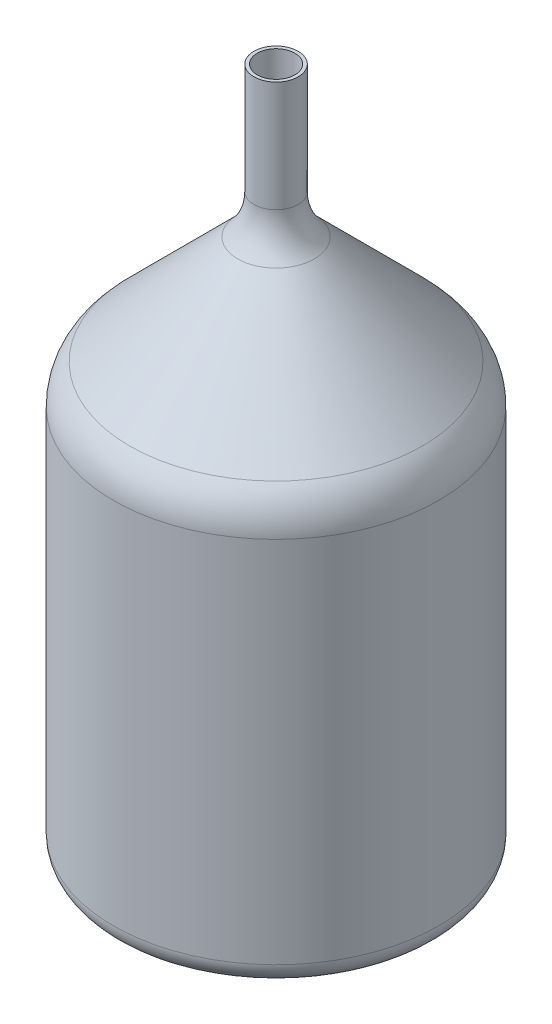
ISO-10303-21;
HEADER;
FILE_DESCRIPTION(('STEP AP214'),'2;1');
FILE_NAME('part.step','',(''),(''),'','','');
FILE_SCHEMA(('AUTOMOTIVE_DESIGN { 1 0 10303 214 1 1 1 1 }'));
ENDSEC;
DATA;
#1=APPLICATION_CONTEXT('core data for automotive mechanical design processes');
#2=APPLICATION_PROTOCOL_DEFINITION('international standard','automotive_design',2000,#1);
#3=PRODUCT_CONTEXT('',#1,'mechanical');
#4=PRODUCT('Part','Part','',(#3));
#5=PRODUCT_RELATED_PRODUCT_CATEGORY('part','',(#4));
#6=PRODUCT_DEFINITION_FORMATION('','',#4);
#7=PRODUCT_DEFINITION_CONTEXT('part definition',#1,'design');
#8=PRODUCT_DEFINITION('design','',#6,#7);
#9=PRODUCT_DEFINITION_SHAPE('','',#8);
#10=(LENGTH_UNIT() NAMED_UNIT(*) SI_UNIT(.MILLI.,.METRE.));
#11=(NAMED_UNIT(*) PLANE_ANGLE_UNIT() SI_UNIT($,.RADIAN.));
#12=(NAMED_UNIT(*) SI_UNIT($,.STERADIAN.) SOLID_ANGLE_UNIT());
#13=UNCERTAINTY_MEASURE_WITH_UNIT(LENGTH_MEASURE(1.E-05),#10,'distance_accuracy_value','');
#14=(GEOMETRIC_REPRESENTATION_CONTEXT(3) GLOBAL_UNCERTAINTY_ASSIGNED_CONTEXT((#13)) GLOBAL_UNIT_ASSIGNED_CONTEXT((#10,
#11,#12)) REPRESENTATION_CONTEXT('',''));
#15=CARTESIAN_POINT('',(0.,0.,0.));
#16=DIRECTION('',(0.,0.,1.));
#17=DIRECTION('',(1.,0.,0.));
#18=AXIS2_PLACEMENT_3D('',#15,#16,#17);
#19=CARTESIAN_POINT('',(0.,0.,0.));
#20=DIRECTION('',(0.,-1.,0.));
#21=DIRECTION('',(0.,0.,-1.));
#22=AXIS2_PLACEMENT_3D('',#19,#20,#21);
#23=CYLINDRICAL_SURFACE('',#22,8.5);
#24=CARTESIAN_POINT('',(0.,260.8,0.));
#25=DIRECTION('',(0.,-1.,0.));
#26=DIRECTION('',(0.,0.,-1.));
#27=AXIS2_PLACEMENT_3D('',#24,#25,#26);
#28=CIRCLE('',#27,8.5);
#29=CARTESIAN_POINT('',(0.,260.8,-8.5));
#30=VERTEX_POINT('',#29);
#31=EDGE_CURVE('E79',#30,#30,#28,.T.);
#32=ORIENTED_EDGE('',*,*,#31,.T.);
#33=EDGE_LOOP('',(#32));
#34=FACE_BOUND('',#33,.T.);
#35=CARTESIAN_POINT('',(0.,310.8,0.));
#36=DIRECTION('',(0.,-1.,0.));
#37=DIRECTION('',(0.,0.,-1.));
#38=AXIS2_PLACEMENT_3D('',#35,#36,#37);
#39=CIRCLE('',#38,8.5);
#40=CARTESIAN_POINT('',(0.,310.8,-8.5));
#41=VERTEX_POINT('',#40);
#42=EDGE_CURVE('E10',#41,#41,#39,.T.);
#43=ORIENTED_EDGE('',*,*,#42,.F.);
#44=EDGE_LOOP('',(#43));
#45=FACE_BOUND('',#44,.T.);
#46=ADVANCED_FACE('F33',(#34,#45),#23,.F.);
#47=CARTESIAN_POINT('',(-10.,310.8,0.));
#48=DIRECTION('',(0.,1.,0.));
#49=DIRECTION('',(0.,0.,1.));
#50=AXIS2_PLACEMENT_3D('',#47,#48,#49);
#51=PLANE('',#50);
#52=ORIENTED_EDGE('',*,*,#42,.T.);
#53=EDGE_LOOP('',(#52));
#54=FACE_BOUND('',#53,.T.);
#55=CARTESIAN_POINT('',(0.,310.8,0.));
#56=DIRECTION('',(0.,-1.,0.));
#57=DIRECTION('',(0.,0.,-1.));
#58=AXIS2_PLACEMENT_3D('',#55,#56,#57);
#59=CIRCLE('',#58,10.);
#60=CARTESIAN_POINT('',(0.,310.8,-10.));
#61=VERTEX_POINT('',#60);
#62=EDGE_CURVE('E39',#61,#61,#59,.T.);
#63=ORIENTED_EDGE('',*,*,#62,.F.);
#64=EDGE_LOOP('',(#63));
#65=FACE_BOUND('',#64,.T.);
#66=ADVANCED_FACE('F126',(#54,#65),#51,.T.);
#67=CARTESIAN_POINT('',(0.,0.,0.));
#68=DIRECTION('',(0.,-1.,0.));
#69=DIRECTION('',(0.,0.,-1.));
#70=AXIS2_PLACEMENT_3D('',#67,#68,#69);
#71=CYLINDRICAL_SURFACE('',#70,9.99999999999999);
#72=ORIENTED_EDGE('',*,*,#62,.T.);
#73=EDGE_LOOP('',(#72));
#74=FACE_BOUND('',#73,.T.);
#75=CARTESIAN_POINT('',(0.,260.8,0.));
#76=DIRECTION('',(0.,-1.,0.));
#77=DIRECTION('',(0.,0.,-1.));
#78=AXIS2_PLACEMENT_3D('',#75,#76,#77);
#79=CIRCLE('',#78,9.99999999999999);
#80=CARTESIAN_POINT('',(0.,260.8,-9.99999999999999));
#81=VERTEX_POINT('',#80);
#82=EDGE_CURVE('E43',#81,#81,#79,.T.);
#83=ORIENTED_EDGE('',*,*,#82,.F.);
#84=EDGE_LOOP('',(#83));
#85=FACE_BOUND('',#84,.T.);
#86=ADVANCED_FACE('F130',(#74,#85),#71,.T.);
#87=CARTESIAN_POINT('',(0.,260.8,0.));
#88=DIRECTION('',(0.,-1.,0.));
#89=DIRECTION('',(0.,0.,-1.));
#90=AXIS2_PLACEMENT_3D('',#87,#88,#89);
#91=TOROIDAL_SURFACE('',#90,35.,25.);
#92=ORIENTED_EDGE('',*,*,#82,.T.);
#93=EDGE_LOOP('',(#92));
#94=FACE_BOUND('',#93,.T.);
#95=CARTESIAN_POINT('',(0.,243.122330470336,0.));
#96=DIRECTION('',(0.,-1.,0.));
#97=DIRECTION('',(0.,0.,-1.));
#98=AXIS2_PLACEMENT_3D('',#95,#96,#97);
#99=CIRCLE('',#98,17.3223304703363);
#100=CARTESIAN_POINT('',(0.,243.122330470336,-17.3223304703363));
#101=VERTEX_POINT('',#100);
#102=EDGE_CURVE('E47',#101,#101,#99,.T.);
#103=ORIENTED_EDGE('',*,*,#102,.F.);
#104=EDGE_LOOP('',(#103));
#105=FACE_BOUND('',#104,.T.);
#106=ADVANCED_FACE('F134',(#94,#105),#91,.F.);
#107=CARTESIAN_POINT('',(0.,194.266991411009,0.));
#108=DIRECTION('',(0.,-1.,0.));
#109=DIRECTION('',(0.,0.,-1.));
#110=AXIS2_PLACEMENT_3D('',#107,#108,#109);
#111=CONICAL_SURFACE('',#110,66.1776695296637,0.78539816339745);
#112=CARTESIAN_POINT('',(0.,194.266991411009,0.));
#113=DIRECTION('',(0.,-1.,0.));
#114=DIRECTION('',(0.,0.,-1.));
#115=AXIS2_PLACEMENT_3D('',#112,#113,#114);
#116=CIRCLE('',#115,66.1776695296637);
#117=CARTESIAN_POINT('',(0.,194.266991411009,-66.1776695296636));
#118=VERTEX_POINT('',#117);
#119=EDGE_CURVE('E52',#118,#118,#116,.T.);
#120=CARTESIAN_POINT('',(0.,243.122330470336,-17.3223304703363));
#121=CARTESIAN_POINT('',(0.,242.613420688468,-17.8312402522043));
#122=CARTESIAN_POINT('',(0.,242.1045109066,-18.3401500340723));
#123=CARTESIAN_POINT('',(0.,241.086691342864,-19.3579695978083));
#124=CARTESIAN_POINT('',(0.,240.577781560996,-19.8668793796763));
#125=CARTESIAN_POINT('',(0.,239.55996199726,-20.8846989434123));
#126=CARTESIAN_POINT('',(0.,239.051052215392,-21.3936087252803));
#127=CARTESIAN_POINT('',(0.,238.033232651656,-22.4114282890162));
#128=CARTESIAN_POINT('',(0.,237.524322869788,-22.9203380708842));
#129=CARTESIAN_POINT('',(0.,236.506503306052,-23.9381576346202));
#130=CARTESIAN_POINT('',(0.,235.997593524184,-24.4470674164882));
#131=CARTESIAN_POINT('',(0.,234.979773960448,-25.4648869802242));
#132=CARTESIAN_POINT('',(0.,234.47086417858,-25.9737967620922));
#133=CARTESIAN_POINT('',(0.,233.453044614844,-26.9916163258282));
#134=CARTESIAN_POINT('',(0.,232.944134832976,-27.5005261076962));
#135=CARTESIAN_POINT('',(0.,231.926315269241,-28.5183456714322));
#136=CARTESIAN_POINT('',(0.,231.417405487373,-29.0272554533002));
#137=CARTESIAN_POINT('',(0.,230.399585923637,-30.0450750170361));
#138=CARTESIAN_POINT('',(0.,229.890676141769,-30.5539847989041));
#139=CARTESIAN_POINT('',(0.,228.872856578033,-31.5718043626401));
#140=CARTESIAN_POINT('',(0.,228.363946796165,-32.0807141445081));
#141=CARTESIAN_POINT('',(0.,227.346127232429,-33.0985337082441));
#142=CARTESIAN_POINT('',(0.,226.837217450561,-33.6074434901121));
#143=CARTESIAN_POINT('',(0.,225.819397886825,-34.6252630538481));
#144=CARTESIAN_POINT('',(0.,225.310488104957,-35.1341728357161));
#145=CARTESIAN_POINT('',(0.,224.292668541221,-36.151992399452));
#146=CARTESIAN_POINT('',(0.,223.783758759353,-36.66090218132));
#147=CARTESIAN_POINT('',(0.,222.765939195617,-37.678721745056));
#148=CARTESIAN_POINT('',(0.,222.257029413749,-38.187631526924));
#149=CARTESIAN_POINT('',(0.,221.239209850013,-39.20545109066));
#150=CARTESIAN_POINT('',(0.,220.730300068145,-39.714360872528));
#151=CARTESIAN_POINT('',(0.,219.712480504409,-40.732180436264));
#152=CARTESIAN_POINT('',(0.,219.203570722541,-41.241090218132));
#153=CARTESIAN_POINT('',(0.,218.185751158805,-42.258909781868));
#154=CARTESIAN_POINT('',(0.,217.676841376937,-42.767819563736));
#155=CARTESIAN_POINT('',(0.,216.659021813201,-43.785639127472));
#156=CARTESIAN_POINT('',(0.,216.150112031333,-44.2945489093399));
#157=CARTESIAN_POINT('',(0.,215.132292467597,-45.3123684730759));
#158=CARTESIAN_POINT('',(0.,214.623382685729,-45.8212782549439));
#159=CARTESIAN_POINT('',(0.,213.605563121993,-46.8390978186799));
#160=CARTESIAN_POINT('',(0.,213.096653340125,-47.3480076005479));
#161=CARTESIAN_POINT('',(0.,212.078833776389,-48.3658271642839));
#162=CARTESIAN_POINT('',(0.,211.569923994521,-48.8747369461519));
#163=CARTESIAN_POINT('',(0.,210.552104430785,-49.8925565098879));
#164=CARTESIAN_POINT('',(0.,210.043194648917,-50.4014662917559));
#165=CARTESIAN_POINT('',(0.,209.025375085181,-51.4192858554918));
#166=CARTESIAN_POINT('',(0.,208.516465303313,-51.9281956373598));
#167=CARTESIAN_POINT('',(0.,207.498645739577,-52.9460152010958));
#168=CARTESIAN_POINT('',(0.,206.989735957709,-53.4549249829638));
#169=CARTESIAN_POINT('',(0.,205.971916393973,-54.4727445466998));
#170=CARTESIAN_POINT('',(0.,205.463006612105,-54.9816543285678));
#171=CARTESIAN_POINT('',(0.,204.445187048369,-55.9994738923038));
#172=CARTESIAN_POINT('',(0.,203.936277266501,-56.5083836741718));
#173=CARTESIAN_POINT('',(0.,202.918457702765,-57.5262032379078));
#174=CARTESIAN_POINT('',(0.,202.409547920897,-58.0351130197758));
#175=CARTESIAN_POINT('',(0.,201.391728357161,-59.0529325835117));
#176=CARTESIAN_POINT('',(0.,200.882818575293,-59.5618423653797));
#177=CARTESIAN_POINT('',(0.,199.864999011557,-60.5796619291157));
#178=CARTESIAN_POINT('',(0.,199.356089229689,-61.0885717109837));
#179=CARTESIAN_POINT('',(0.,198.338269665953,-62.1063912747197));
#180=CARTESIAN_POINT('',(0.,197.829359884085,-62.6153010565877));
#181=CARTESIAN_POINT('',(0.,196.811540320349,-63.6331206203237));
#182=CARTESIAN_POINT('',(0.,196.302630538481,-64.1420304021917));
#183=CARTESIAN_POINT('',(0.,195.284810974745,-65.1598499659276));
#184=CARTESIAN_POINT('',(0.,194.775901192877,-65.6687597477956));
#185=CARTESIAN_POINT('',(0.,194.266991411009,-66.1776695296636));
#186=B_SPLINE_CURVE_WITH_KNOTS('',3,(#120,#121,#122,#123,#124,#125,#126,#127,#128,#129,#130,
#131,#132,#133,#134,#135,#136,#137,#138,#139,#140,#141,#142,#143,#144,#145,#146,#147,#148,#149,
#150,#151,#152,#153,#154,#155,#156,#157,#158,#159,#160,#161,#162,#163,#164,#165,#166,#167,#168,
#169,#170,#171,#172,#173,#174,#175,#176,#177,#178,#179,#180,#181,#182,#183,#184,#185),
.UNSPECIFIED.,.F.,.F.,(4,2,2,2,2,2,2,2,2,2,2,2,2,2,2,2,2,2,2,2,2,2,2,2,2,2,2,2,2,2,2,2,4),(0.,
2.15912134662616,4.3182426932523,6.47736403987843,8.63648538650459,10.7956067331307,
12.9547280797569,15.113849426383,17.2729707730091,19.4320921196353,21.5912134662614,
23.7503348128876,25.9094561595137,28.0685775061399,30.227698852766,32.3868201993922,
34.5459415460183,36.7050628926445,38.8641842392706,41.0233055858967,43.1824269325229,
45.341548279149,47.5006696257752,49.6597909724013,51.8189123190274,53.9780336656536,
56.1371550122797,58.2962763589059,60.455397705532,62.6145190521582,64.7736403987843,
66.9327617454104,69.0918830920366),.UNSPECIFIED.);
#187=EDGE_CURVE('BSEAM140',#101,#118,#186,.T.);
#188=ORIENTED_EDGE('',*,*,#102,.T.);
#189=ORIENTED_EDGE('',*,*,#119,.F.);
#190=ORIENTED_EDGE('',*,*,#187,.T.);
#191=ORIENTED_EDGE('',*,*,#187,.F.);
#192=EDGE_LOOP('',(#188,#190,#189,#191));
#193=FACE_BOUND('',#192,.T.);
#194=ADVANCED_FACE('F140',(#193),#111,.T.);
#195=CARTESIAN_POINT('',(0.,176.589321881345,0.));
#196=DIRECTION('',(0.,-1.,0.));
#197=DIRECTION('',(0.,0.,-1.));
#198=AXIS2_PLACEMENT_3D('',#195,#196,#197);
#199=TOROIDAL_SURFACE('',#198,48.5,25.);
#200=ORIENTED_EDGE('',*,*,#119,.T.);
#201=EDGE_LOOP('',(#200));
#202=FACE_BOUND('',#201,.T.);
#203=CARTESIAN_POINT('',(0.,176.589321881345,0.));
#204=DIRECTION('',(0.,-1.,0.));
#205=DIRECTION('',(0.,0.,-1.));
#206=AXIS2_PLACEMENT_3D('',#203,#204,#205);
#207=CIRCLE('',#206,73.5);
#208=CARTESIAN_POINT('',(0.,176.589321881345,-73.5));
#209=VERTEX_POINT('',#208);
#210=EDGE_CURVE('E55',#209,#209,#207,.T.);
#211=ORIENTED_EDGE('',*,*,#210,.F.);
#212=EDGE_LOOP('',(#211));
#213=FACE_BOUND('',#212,.T.);
#214=ADVANCED_FACE('F144',(#202,#213),#199,.T.);
#215=CARTESIAN_POINT('',(0.,0.,0.));
#216=DIRECTION('',(0.,-1.,0.));
#217=DIRECTION('',(0.,0.,-1.));
#218=AXIS2_PLACEMENT_3D('',#215,#216,#217);
#219=CYLINDRICAL_SURFACE('',#218,73.5);
#220=ORIENTED_EDGE('',*,*,#210,.T.);
#221=EDGE_LOOP('',(#220));
#222=FACE_BOUND('',#221,.T.);
#223=CARTESIAN_POINT('',(0.,9.99999999999999,0.));
#224=DIRECTION('',(0.,-1.,0.));
#225=DIRECTION('',(0.,0.,-1.));
#226=AXIS2_PLACEMENT_3D('',#223,#224,#225);
#227=CIRCLE('',#226,73.5);
#228=CARTESIAN_POINT('',(0.,9.99999999999999,-73.5));
#229=VERTEX_POINT('',#228);
#230=EDGE_CURVE('E58',#229,#229,#227,.T.);
#231=ORIENTED_EDGE('',*,*,#230,.F.);
#232=EDGE_LOOP('',(#231));
#233=FACE_BOUND('',#232,.T.);
#234=ADVANCED_FACE('F148',(#222,#233),#219,.T.);
#235=CARTESIAN_POINT('',(0.,9.99999999999999,0.));
#236=DIRECTION('',(0.,-1.,0.));
#237=DIRECTION('',(0.,0.,-1.));
#238=AXIS2_PLACEMENT_3D('',#235,#236,#237);
#239=TOROIDAL_SURFACE('',#238,63.5,10.);
#240=ORIENTED_EDGE('',*,*,#230,.T.);
#241=EDGE_LOOP('',(#240));
#242=FACE_BOUND('',#241,.T.);
#243=CARTESIAN_POINT('',(0.,0.,0.));
#244=DIRECTION('',(0.,-1.,0.));
#245=DIRECTION('',(0.,0.,-1.));
#246=AXIS2_PLACEMENT_3D('',#243,#244,#245);
#247=CIRCLE('',#246,63.5);
#248=CARTESIAN_POINT('',(0.,0.,-63.5));
#249=VERTEX_POINT('',#248);
#250=EDGE_CURVE('E61',#249,#249,#247,.T.);
#251=ORIENTED_EDGE('',*,*,#250,.F.);
#252=EDGE_LOOP('',(#251));
#253=FACE_BOUND('',#252,.T.);
#254=ADVANCED_FACE('F122',(#242,#253),#239,.T.);
#255=CARTESIAN_POINT('',(0.,0.,0.));
#256=DIRECTION('',(0.,-1.,0.));
#257=DIRECTION('',(0.,0.,-1.));
#258=AXIS2_PLACEMENT_3D('',#255,#256,#257);
#259=PLANE('',#258);
#260=ORIENTED_EDGE('',*,*,#250,.T.);
#261=EDGE_LOOP('',(#260));
#262=FACE_BOUND('',#261,.T.);
#263=ADVANCED_FACE('F117',(#262),#259,.T.);
#264=CARTESIAN_POINT('',(0.,1.5,0.));
#265=DIRECTION('',(0.,-1.,0.));
#266=DIRECTION('',(0.,0.,-1.));
#267=AXIS2_PLACEMENT_3D('',#264,#265,#266);
#268=PLANE('',#267);
#269=CARTESIAN_POINT('',(0.,1.49999999999999,0.));
#270=DIRECTION('',(0.,-1.,0.));
#271=DIRECTION('',(0.,0.,-1.));
#272=AXIS2_PLACEMENT_3D('',#269,#270,#271);
#273=CIRCLE('',#272,63.5);
#274=CARTESIAN_POINT('',(0.,1.49999999999999,-63.5));
#275=VERTEX_POINT('',#274);
#276=EDGE_CURVE('E64',#275,#275,#273,.T.);
#277=ORIENTED_EDGE('',*,*,#276,.F.);
#278=EDGE_LOOP('',(#277));
#279=FACE_BOUND('',#278,.T.);
#280=ADVANCED_FACE('F112',(#279),#268,.F.);
#281=CARTESIAN_POINT('',(0.,9.99999999999999,0.));
#282=DIRECTION('',(0.,-1.,0.));
#283=DIRECTION('',(0.,0.,-1.));
#284=AXIS2_PLACEMENT_3D('',#281,#282,#283);
#285=TOROIDAL_SURFACE('',#284,63.5,8.5);
#286=CARTESIAN_POINT('',(0.,9.99999999999999,0.));
#287=DIRECTION('',(0.,-1.,0.));
#288=DIRECTION('',(0.,0.,-1.));
#289=AXIS2_PLACEMENT_3D('',#286,#287,#288);
#290=CIRCLE('',#289,72.);
#291=CARTESIAN_POINT('',(0.,9.99999999999999,-72.));
#292=VERTEX_POINT('',#291);
#293=EDGE_CURVE('E67',#292,#292,#290,.T.);
#294=ORIENTED_EDGE('',*,*,#293,.F.);
#295=EDGE_LOOP('',(#294));
#296=FACE_BOUND('',#295,.T.);
#297=ORIENTED_EDGE('',*,*,#276,.T.);
#298=EDGE_LOOP('',(#297));
#299=FACE_BOUND('',#298,.T.);
#300=ADVANCED_FACE('F106',(#296,#299),#285,.F.);
#301=CARTESIAN_POINT('',(0.,0.,0.));
#302=DIRECTION('',(0.,-1.,0.));
#303=DIRECTION('',(0.,0.,-1.));
#304=AXIS2_PLACEMENT_3D('',#301,#302,#303);
#305=CYLINDRICAL_SURFACE('',#304,72.);
#306=CARTESIAN_POINT('',(0.,176.589321881345,0.));
#307=DIRECTION('',(0.,-1.,0.));
#308=DIRECTION('',(0.,0.,-1.));
#309=AXIS2_PLACEMENT_3D('',#306,#307,#308);
#310=CIRCLE('',#309,72.);
#311=CARTESIAN_POINT('',(0.,176.589321881345,-72.));
#312=VERTEX_POINT('',#311);
#313=EDGE_CURVE('E70',#312,#312,#310,.T.);
#314=ORIENTED_EDGE('',*,*,#313,.F.);
#315=EDGE_LOOP('',(#314));
#316=FACE_BOUND('',#315,.T.);
#317=ORIENTED_EDGE('',*,*,#293,.T.);
#318=EDGE_LOOP('',(#317));
#319=FACE_BOUND('',#318,.T.);
#320=ADVANCED_FACE('F100',(#316,#319),#305,.F.);
#321=CARTESIAN_POINT('',(0.,176.589321881345,0.));
#322=DIRECTION('',(0.,-1.,0.));
#323=DIRECTION('',(0.,0.,-1.));
#324=AXIS2_PLACEMENT_3D('',#321,#322,#323);
#325=TOROIDAL_SURFACE('',#324,48.5,23.5);
#326=CARTESIAN_POINT('',(0.,193.206331239229,0.));
#327=DIRECTION('',(0.,-1.,0.));
#328=DIRECTION('',(0.,0.,-1.));
#329=AXIS2_PLACEMENT_3D('',#326,#327,#328);
#330=CIRCLE('',#329,65.1170093578838);
#331=CARTESIAN_POINT('',(0.,193.206331239229,-65.1170093578838));
#332=VERTEX_POINT('',#331);
#333=EDGE_CURVE('E73',#332,#332,#330,.T.);
#334=ORIENTED_EDGE('',*,*,#333,.F.);
#335=EDGE_LOOP('',(#334));
#336=FACE_BOUND('',#335,.T.);
#337=ORIENTED_EDGE('',*,*,#313,.T.);
#338=EDGE_LOOP('',(#337));
#339=FACE_BOUND('',#338,.T.);
#340=ADVANCED_FACE('F94',(#336,#339),#325,.F.);
#341=CARTESIAN_POINT('',(0.,193.206331239229,0.));
#342=DIRECTION('',(0.,-1.,0.));
#343=DIRECTION('',(0.,0.,-1.));
#344=AXIS2_PLACEMENT_3D('',#341,#342,#343);
#345=CONICAL_SURFACE('',#344,65.1170093578838,0.78539816339745);
#346=CARTESIAN_POINT('',(0.,242.061670298556,0.));
#347=DIRECTION('',(0.,-1.,0.));
#348=DIRECTION('',(0.,0.,-1.));
#349=AXIS2_PLACEMENT_3D('',#346,#347,#348);
#350=CIRCLE('',#349,16.2616702985565);
#351=CARTESIAN_POINT('',(0.,242.061670298556,-16.2616702985565));
#352=VERTEX_POINT('',#351);
#353=EDGE_CURVE('E76',#352,#352,#350,.T.);
#354=CARTESIAN_POINT('',(0.,242.061670298556,-16.2616702985565));
#355=CARTESIAN_POINT('',(0.,241.552760516688,-16.7705800804245));
#356=CARTESIAN_POINT('',(0.,241.04385073482,-17.2794898622925));
#357=CARTESIAN_POINT('',(0.,240.026031171084,-18.2973094260285));
#358=CARTESIAN_POINT('',(0.,239.517121389217,-18.8062192078965));
#359=CARTESIAN_POINT('',(0.,238.499301825481,-19.8240387716325));
#360=CARTESIAN_POINT('',(0.,237.990392043613,-20.3329485535004));
#361=CARTESIAN_POINT('',(0.,236.972572479877,-21.3507681172364));
#362=CARTESIAN_POINT('',(0.,236.463662698009,-21.8596778991044));
#363=CARTESIAN_POINT('',(0.,235.445843134273,-22.8774974628404));
#364=CARTESIAN_POINT('',(0.,234.936933352405,-23.3864072447084));
#365=CARTESIAN_POINT('',(0.,233.919113788669,-24.4042268084444));
#366=CARTESIAN_POINT('',(0.,233.410204006801,-24.9131365903124));
#367=CARTESIAN_POINT('',(0.,232.392384443065,-25.9309561540484));
#368=CARTESIAN_POINT('',(0.,231.883474661197,-26.4398659359164));
#369=CARTESIAN_POINT('',(0.,230.865655097461,-27.4576854996523));
#370=CARTESIAN_POINT('',(0.,230.356745315593,-27.9665952815203));
#371=CARTESIAN_POINT('',(0.,229.338925751857,-28.9844148452563));
#372=CARTESIAN_POINT('',(0.,228.830015969989,-29.4933246271243));
#373=CARTESIAN_POINT('',(0.,227.812196406253,-30.5111441908603));
#374=CARTESIAN_POINT('',(0.,227.303286624385,-31.0200539727283));
#375=CARTESIAN_POINT('',(0.,226.285467060649,-32.0378735364643));
#376=CARTESIAN_POINT('',(0.,225.776557278781,-32.5467833183323));
#377=CARTESIAN_POINT('',(0.,224.758737715045,-33.5646028820683));
#378=CARTESIAN_POINT('',(0.,224.249827933177,-34.0735126639363));
#379=CARTESIAN_POINT('',(0.,223.232008369441,-35.0913322276722));
#380=CARTESIAN_POINT('',(0.,222.723098587573,-35.6002420095402));
#381=CARTESIAN_POINT('',(0.,221.705279023837,-36.6180615732762));
#382=CARTESIAN_POINT('',(0.,221.196369241969,-37.1269713551442));
#383=CARTESIAN_POINT('',(0.,220.178549678233,-38.1447909188802));
#384=CARTESIAN_POINT('',(0.,219.669639896365,-38.6537007007482));
#385=CARTESIAN_POINT('',(0.,218.651820332629,-39.6715202644842));
#386=CARTESIAN_POINT('',(0.,218.142910550761,-40.1804300463522));
#387=CARTESIAN_POINT('',(0.,217.125090987025,-41.1982496100882));
#388=CARTESIAN_POINT('',(0.,216.616181205157,-41.7071593919561));
#389=CARTESIAN_POINT('',(0.,215.598361641421,-42.7249789556921));
#390=CARTESIAN_POINT('',(0.,215.089451859553,-43.2338887375601));
#391=CARTESIAN_POINT('',(0.,214.071632295817,-44.2517083012961));
#392=CARTESIAN_POINT('',(0.,213.562722513949,-44.7606180831641));
#393=CARTESIAN_POINT('',(0.,212.544902950213,-45.7784376469001));
#394=CARTESIAN_POINT('',(0.,212.035993168345,-46.2873474287681));
#395=CARTESIAN_POINT('',(0.,211.018173604609,-47.3051669925041));
#396=CARTESIAN_POINT('',(0.,210.509263822741,-47.8140767743721));
#397=CARTESIAN_POINT('',(0.,209.491444259005,-48.831896338108));
#398=CARTESIAN_POINT('',(0.,208.982534477137,-49.340806119976));
#399=CARTESIAN_POINT('',(0.,207.964714913401,-50.358625683712));
#400=CARTESIAN_POINT('',(0.,207.455805131533,-50.86753546558));
#401=CARTESIAN_POINT('',(0.,206.437985567797,-51.885355029316));
#402=CARTESIAN_POINT('',(0.,205.929075785929,-52.394264811184));
#403=CARTESIAN_POINT('',(0.,204.911256222193,-53.41208437492));
#404=CARTESIAN_POINT('',(0.,204.402346440325,-53.920994156788));
#405=CARTESIAN_POINT('',(0.,203.384526876589,-54.938813720524));
#406=CARTESIAN_POINT('',(0.,202.875617094721,-55.447723502392));
#407=CARTESIAN_POINT('',(0.,201.857797530985,-56.4655430661279));
#408=CARTESIAN_POINT('',(0.,201.348887749117,-56.9744528479959));
#409=CARTESIAN_POINT('',(0.,200.331068185381,-57.9922724117319));
#410=CARTESIAN_POINT('',(0.,199.822158403513,-58.5011821935999));
#411=CARTESIAN_POINT('',(0.,198.804338839777,-59.5190017573359));
#412=CARTESIAN_POINT('',(0.,198.295429057909,-60.0279115392039));
#413=CARTESIAN_POINT('',(0.,197.277609494173,-61.0457311029399));
#414=CARTESIAN_POINT('',(0.,196.768699712305,-61.5546408848079));
#415=CARTESIAN_POINT('',(0.,195.750880148569,-62.5724604485439));
#416=CARTESIAN_POINT('',(0.,195.241970366701,-63.0813702304119));
#417=CARTESIAN_POINT('',(0.,194.224150802965,-64.0991897941478));
#418=CARTESIAN_POINT('',(0.,193.715241021097,-64.6080995760158));
#419=CARTESIAN_POINT('',(0.,193.206331239229,-65.1170093578838));
#420=B_SPLINE_CURVE_WITH_KNOTS('',3,(#354,#355,#356,#357,#358,#359,#360,#361,#362,#363,#364,
#365,#366,#367,#368,#369,#370,#371,#372,#373,#374,#375,#376,#377,#378,#379,#380,#381,#382,#383,
#384,#385,#386,#387,#388,#389,#390,#391,#392,#393,#394,#395,#396,#397,#398,#399,#400,#401,#402,
#403,#404,#405,#406,#407,#408,#409,#410,#411,#412,#413,#414,#415,#416,#417,#418,#419),
.UNSPECIFIED.,.F.,.F.,(4,2,2,2,2,2,2,2,2,2,2,2,2,2,2,2,2,2,2,2,2,2,2,2,2,2,2,2,2,2,2,2,4),(0.,
2.15912134662614,4.31824269325228,6.47736403987841,8.63648538650455,10.7956067331307,
12.9547280797569,15.113849426383,17.2729707730091,19.4320921196353,21.5912134662614,
23.7503348128876,25.9094561595137,28.0685775061399,30.227698852766,32.3868201993921,
34.5459415460183,36.7050628926444,38.8641842392706,41.0233055858967,43.1824269325228,
45.341548279149,47.5006696257751,49.6597909724013,51.8189123190274,53.9780336656536,
56.1371550122797,58.2962763589058,60.455397705532,62.6145190521581,64.7736403987843,
66.9327617454104,69.0918830920366),.UNSPECIFIED.);
#421=EDGE_CURVE('BSEAM88',#352,#332,#420,.T.);
#422=ORIENTED_EDGE('',*,*,#353,.F.);
#423=ORIENTED_EDGE('',*,*,#333,.T.);
#424=ORIENTED_EDGE('',*,*,#421,.T.);
#425=ORIENTED_EDGE('',*,*,#421,.F.);
#426=EDGE_LOOP('',(#422,#424,#423,#425));
#427=FACE_BOUND('',#426,.T.);
#428=ADVANCED_FACE('F88',(#427),#345,.F.);
#429=CARTESIAN_POINT('',(0.,260.8,0.));
#430=DIRECTION('',(0.,-1.,0.));
#431=DIRECTION('',(0.,0.,-1.));
#432=AXIS2_PLACEMENT_3D('',#429,#430,#431);
#433=TOROIDAL_SURFACE('',#432,35.,26.5);
#434=ORIENTED_EDGE('',*,*,#31,.F.);
#435=EDGE_LOOP('',(#434));
#436=FACE_BOUND('',#435,.T.);
#437=ORIENTED_EDGE('',*,*,#353,.T.);
#438=EDGE_LOOP('',(#437));
#439=FACE_BOUND('',#438,.T.);
#440=ADVANCED_FACE('F85',(#436,#439),#433,.T.);
#441=CLOSED_SHELL('',(#46,#66,#86,#106,#194,#214,#234,#254,#263,#280,#300,#320,#340,#428,#440));
#442=MANIFOLD_SOLID_BREP('B2',#441);
#443=ADVANCED_BREP_SHAPE_REPRESENTATION('',(#18,#442),#14);
#444=SHAPE_DEFINITION_REPRESENTATION(#9,#443);
ENDSEC;
END-ISO-10303-21;
